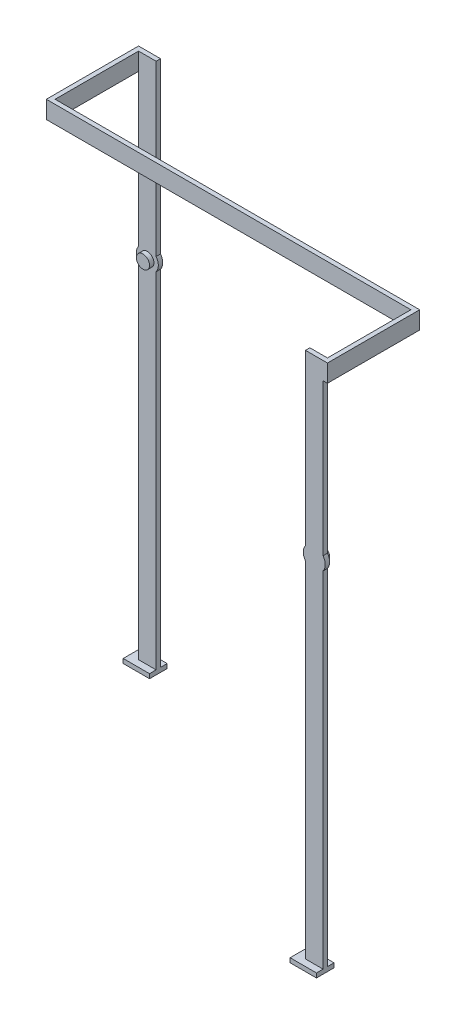
ISO-10303-21;
HEADER;
FILE_DESCRIPTION(('STEP AP214'),'2;1');
FILE_NAME('part.step','',(''),(''),'','','');
FILE_SCHEMA(('AUTOMOTIVE_DESIGN { 1 0 10303 214 1 1 1 1 }'));
ENDSEC;
DATA;
#1=APPLICATION_CONTEXT('core data for automotive mechanical design processes');
#2=APPLICATION_PROTOCOL_DEFINITION('international standard','automotive_design',2000,#1);
#3=PRODUCT_CONTEXT('',#1,'mechanical');
#4=PRODUCT('Part','Part','',(#3));
#5=PRODUCT_RELATED_PRODUCT_CATEGORY('part','',(#4));
#6=PRODUCT_DEFINITION_FORMATION('','',#4);
#7=PRODUCT_DEFINITION_CONTEXT('part definition',#1,'design');
#8=PRODUCT_DEFINITION('design','',#6,#7);
#9=PRODUCT_DEFINITION_SHAPE('','',#8);
#10=(LENGTH_UNIT() NAMED_UNIT(*) SI_UNIT(.MILLI.,.METRE.));
#11=(NAMED_UNIT(*) PLANE_ANGLE_UNIT() SI_UNIT($,.RADIAN.));
#12=(NAMED_UNIT(*) SI_UNIT($,.STERADIAN.) SOLID_ANGLE_UNIT());
#13=UNCERTAINTY_MEASURE_WITH_UNIT(LENGTH_MEASURE(1.E-05),#10,'distance_accuracy_value','');
#14=(GEOMETRIC_REPRESENTATION_CONTEXT(3) GLOBAL_UNCERTAINTY_ASSIGNED_CONTEXT((#13)) GLOBAL_UNIT_ASSIGNED_CONTEXT((#10,
#11,#12)) REPRESENTATION_CONTEXT('',''));
#15=CARTESIAN_POINT('',(0.,0.,0.));
#16=DIRECTION('',(0.,0.,1.));
#17=DIRECTION('',(1.,0.,0.));
#18=AXIS2_PLACEMENT_3D('',#15,#16,#17);
#19=CARTESIAN_POINT('',(-21.3512251283049,81.1533572870647,-20.5));
#20=DIRECTION('',(-1.,0.,0.));
#21=DIRECTION('',(0.,0.,1.));
#22=AXIS2_PLACEMENT_3D('',#19,#20,#21);
#23=PLANE('',#22);
#24=DIRECTION('',(0.,-1.,0.));
#25=VECTOR('',#24,1.);
#26=CARTESIAN_POINT('',(-21.3512251283049,85.1533572870647,-0.5));
#27=LINE('',#26,#25);
#28=CARTESIAN_POINT('',(-21.3512251283049,85.1533572870647,-0.5));
#29=VERTEX_POINT('',#28);
#30=CARTESIAN_POINT('',(-21.3512251283049,81.1533572870647,-0.5));
#31=VERTEX_POINT('',#30);
#32=EDGE_CURVE('E590',#29,#31,#27,.T.);
#33=ORIENTED_EDGE('',*,*,#32,.T.);
#34=DIRECTION('',(0.,0.,1.));
#35=VECTOR('',#34,1.);
#36=CARTESIAN_POINT('',(-21.3512251283049,81.1533572870647,-20.5));
#37=LINE('',#36,#35);
#38=CARTESIAN_POINT('',(-21.3512251283049,81.1533572870647,-19.5));
#39=VERTEX_POINT('',#38);
#40=EDGE_CURVE('E239',#39,#31,#37,.T.);
#41=ORIENTED_EDGE('',*,*,#40,.F.);
#42=DIRECTION('',(0.,1.,0.));
#43=VECTOR('',#42,1.);
#44=CARTESIAN_POINT('',(-21.3512251283049,45.15335728706,-19.5));
#45=LINE('',#44,#43);
#46=CARTESIAN_POINT('',(-21.3512251283049,85.1533572870647,-19.5));
#47=VERTEX_POINT('',#46);
#48=EDGE_CURVE('E267',#39,#47,#45,.T.);
#49=ORIENTED_EDGE('',*,*,#48,.T.);
#50=DIRECTION('',(0.,0.,-1.));
#51=VECTOR('',#50,1.);
#52=CARTESIAN_POINT('',(-21.3512251283049,85.1533572870647,-20.5));
#53=LINE('',#52,#51);
#54=EDGE_CURVE('E244',#29,#47,#53,.T.);
#55=ORIENTED_EDGE('',*,*,#54,.F.);
#56=EDGE_LOOP('',(#33,#41,#49,#55));
#57=FACE_BOUND('',#56,.T.);
#58=ADVANCED_FACE('F31',(#57),#23,.F.);
#59=CARTESIAN_POINT('',(-21.3512251283049,85.1533572870647,-20.5));
#60=DIRECTION('',(1.,0.,0.));
#61=DIRECTION('',(0.,1.,0.));
#62=AXIS2_PLACEMENT_3D('',#59,#60,#61);
#63=PLANE('',#62);
#64=CARTESIAN_POINT('',(-21.3512251283049,81.1533572870647,-20.5));
#65=VERTEX_POINT('',#64);
#66=EDGE_CURVE('E254',#65,#39,#37,.T.);
#67=ORIENTED_EDGE('',*,*,#66,.F.);
#68=DIRECTION('',(0.,1.,0.));
#69=VECTOR('',#68,1.);
#70=CARTESIAN_POINT('',(-21.3512251283049,85.1533572870647,-20.5));
#71=LINE('',#70,#69);
#72=CARTESIAN_POINT('',(-21.3512251283049,46.65335728706,-20.5));
#73=VERTEX_POINT('',#72);
#74=EDGE_CURVE('E274',#73,#65,#71,.T.);
#75=ORIENTED_EDGE('',*,*,#74,.F.);
#76=DIRECTION('',(0.,0.,1.));
#77=VECTOR('',#76,1.);
#78=CARTESIAN_POINT('',(-21.3512251283049,46.65335728706,-20.5));
#79=LINE('',#78,#77);
#80=CARTESIAN_POINT('',(-21.3512251283049,46.65335728706,-19.5));
#81=VERTEX_POINT('',#80);
#82=EDGE_CURVE('E286',#73,#81,#79,.T.);
#83=ORIENTED_EDGE('',*,*,#82,.T.);
#84=DIRECTION('',(0.,1.,0.));
#85=VECTOR('',#84,1.);
#86=CARTESIAN_POINT('',(-21.3512251283049,85.1533572870647,-19.5));
#87=LINE('',#86,#85);
#88=EDGE_CURVE('E129',#81,#39,#87,.T.);
#89=ORIENTED_EDGE('',*,*,#88,.T.);
#90=EDGE_LOOP('',(#67,#75,#83,#89));
#91=FACE_BOUND('',#90,.T.);
#92=ADVANCED_FACE('F285',(#91),#63,.F.);
#93=CARTESIAN_POINT('',(-19.3512251283049,45.15335728706,-19.5));
#94=DIRECTION('',(0.,0.,-1.));
#95=DIRECTION('',(0.,1.,0.));
#96=AXIS2_PLACEMENT_3D('',#93,#94,#95);
#97=PLANE('',#96);
#98=DIRECTION('',(0.,1.,0.));
#99=VECTOR('',#98,1.);
#100=CARTESIAN_POINT('',(-21.3512251283049,43.6533572870599,-19.5));
#101=LINE('',#100,#99);
#102=CARTESIAN_POINT('',(-21.3512251283049,-34.8466427129353,-19.5));
#103=VERTEX_POINT('',#102);
#104=CARTESIAN_POINT('',(-21.3512251283049,43.6533572870599,-19.5));
#105=VERTEX_POINT('',#104);
#106=EDGE_CURVE('E123',#103,#105,#101,.T.);
#107=ORIENTED_EDGE('',*,*,#106,.F.);
#108=DIRECTION('',(-1.,0.,0.));
#109=VECTOR('',#108,1.);
#110=CARTESIAN_POINT('',(-17.3512251283049,-34.8466427129353,-19.5));
#111=LINE('',#110,#109);
#112=CARTESIAN_POINT('',(-17.3512251283049,-34.8466427129353,-19.5));
#113=VERTEX_POINT('',#112);
#114=EDGE_CURVE('E141',#113,#103,#111,.T.);
#115=ORIENTED_EDGE('',*,*,#114,.F.);
#116=DIRECTION('',(0.,-1.,0.));
#117=VECTOR('',#116,1.);
#118=CARTESIAN_POINT('',(-17.3512251283049,43.65335728706,-19.5));
#119=LINE('',#118,#117);
#120=CARTESIAN_POINT('',(-17.3512251283049,43.65335728706,-19.5));
#121=VERTEX_POINT('',#120);
#122=EDGE_CURVE('E136',#121,#113,#119,.T.);
#123=ORIENTED_EDGE('',*,*,#122,.F.);
#124=CARTESIAN_POINT('',(-19.3512251283049,45.15335728706,-19.5));
#125=DIRECTION('',(0.,0.,-1.));
#126=DIRECTION('',(0.,1.,0.));
#127=AXIS2_PLACEMENT_3D('',#124,#125,#126);
#128=CIRCLE('',#127,2.5);
#129=CARTESIAN_POINT('',(-17.3512251283049,46.6533572870599,-19.5));
#130=VERTEX_POINT('',#129);
#131=EDGE_CURVE('E80',#130,#121,#128,.T.);
#132=ORIENTED_EDGE('',*,*,#131,.F.);
#133=DIRECTION('',(0.,-1.,0.));
#134=VECTOR('',#133,1.);
#135=CARTESIAN_POINT('',(-17.3512251283049,85.1533572870647,-19.5));
#136=LINE('',#135,#134);
#137=CARTESIAN_POINT('',(-17.3512251283049,85.1533572870647,-19.5));
#138=VERTEX_POINT('',#137);
#139=EDGE_CURVE('E73',#138,#130,#136,.T.);
#140=ORIENTED_EDGE('',*,*,#139,.F.);
#141=DIRECTION('',(1.,0.,0.));
#142=VECTOR('',#141,1.);
#143=CARTESIAN_POINT('',(-17.3512251283049,85.1533572870647,-19.5));
#144=LINE('',#143,#142);
#145=EDGE_CURVE('E132',#47,#138,#144,.T.);
#146=ORIENTED_EDGE('',*,*,#145,.F.);
#147=ORIENTED_EDGE('',*,*,#48,.F.);
#148=ORIENTED_EDGE('',*,*,#88,.F.);
#149=CARTESIAN_POINT('',(-19.3512251283049,45.15335728706,-19.5));
#150=DIRECTION('',(0.,0.,-1.));
#151=DIRECTION('',(0.,1.,0.));
#152=AXIS2_PLACEMENT_3D('',#149,#150,#151);
#153=CIRCLE('',#152,2.5);
#154=EDGE_CURVE('E126',#105,#81,#153,.T.);
#155=ORIENTED_EDGE('',*,*,#154,.F.);
#156=EDGE_LOOP('',(#107,#115,#123,#132,#140,#146,#147,#148,#155));
#157=FACE_BOUND('',#156,.T.);
#158=CARTESIAN_POINT('',(-19.351225128309,45.1533572870647,-19.5));
#159=DIRECTION('',(0.,0.,-1.));
#160=DIRECTION('',(0.,1.,0.));
#161=AXIS2_PLACEMENT_3D('',#158,#159,#160);
#162=CIRCLE('',#161,1.50000000000253);
#163=CARTESIAN_POINT('',(-19.351225128309,46.6533572870672,-19.5));
#164=VERTEX_POINT('',#163);
#165=EDGE_CURVE('E11',#164,#164,#162,.F.);
#166=ORIENTED_EDGE('',*,*,#165,.F.);
#167=EDGE_LOOP('',(#166));
#168=FACE_BOUND('',#167,.T.);
#169=ADVANCED_FACE('F300',(#157,#168),#97,.F.);
#170=CARTESIAN_POINT('',(-21.3512251283049,43.6533572870599,-20.5));
#171=DIRECTION('',(1.,0.,0.));
#172=DIRECTION('',(0.,1.,0.));
#173=AXIS2_PLACEMENT_3D('',#170,#171,#172);
#174=PLANE('',#173);
#175=ORIENTED_EDGE('',*,*,#106,.T.);
#176=DIRECTION('',(0.,0.,1.));
#177=VECTOR('',#176,1.);
#178=CARTESIAN_POINT('',(-21.3512251283049,43.6533572870599,-20.5));
#179=LINE('',#178,#177);
#180=CARTESIAN_POINT('',(-21.3512251283049,43.6533572870599,-20.5));
#181=VERTEX_POINT('',#180);
#182=EDGE_CURVE('E42',#181,#105,#179,.T.);
#183=ORIENTED_EDGE('',*,*,#182,.F.);
#184=DIRECTION('',(0.,1.,0.));
#185=VECTOR('',#184,1.);
#186=CARTESIAN_POINT('',(-21.3512251283049,43.6533572870599,-20.5));
#187=LINE('',#186,#185);
#188=CARTESIAN_POINT('',(-21.3512251283049,-34.8466427129353,-20.5));
#189=VERTEX_POINT('',#188);
#190=EDGE_CURVE('E144',#189,#181,#187,.T.);
#191=ORIENTED_EDGE('',*,*,#190,.F.);
#192=DIRECTION('',(0.,0.,1.));
#193=VECTOR('',#192,1.);
#194=CARTESIAN_POINT('',(-21.3512251283049,-34.8466427129353,-20.5));
#195=LINE('',#194,#193);
#196=EDGE_CURVE('E51',#189,#103,#195,.T.);
#197=ORIENTED_EDGE('',*,*,#196,.T.);
#198=EDGE_LOOP('',(#175,#183,#191,#197));
#199=FACE_BOUND('',#198,.T.);
#200=ADVANCED_FACE('F33',(#199),#174,.F.);
#201=CARTESIAN_POINT('',(-19.3512251283049,45.15335728706,-20.5));
#202=DIRECTION('',(0.,0.,1.));
#203=DIRECTION('',(0.,-1.,0.));
#204=AXIS2_PLACEMENT_3D('',#201,#202,#203);
#205=CYLINDRICAL_SURFACE('',#204,2.5);
#206=ORIENTED_EDGE('',*,*,#154,.T.);
#207=ORIENTED_EDGE('',*,*,#82,.F.);
#208=CARTESIAN_POINT('',(-19.3512251283049,45.15335728706,-20.5));
#209=DIRECTION('',(0.,0.,-1.));
#210=DIRECTION('',(0.,1.,0.));
#211=AXIS2_PLACEMENT_3D('',#208,#209,#210);
#212=CIRCLE('',#211,2.5);
#213=EDGE_CURVE('E89',#181,#73,#212,.T.);
#214=ORIENTED_EDGE('',*,*,#213,.F.);
#215=ORIENTED_EDGE('',*,*,#182,.T.);
#216=EDGE_LOOP('',(#206,#207,#214,#215));
#217=FACE_BOUND('',#216,.T.);
#218=ADVANCED_FACE('F535',(#217),#205,.T.);
#219=CARTESIAN_POINT('',(-17.3512251283049,85.1533572870647,-20.5));
#220=DIRECTION('',(0.,-1.,0.));
#221=DIRECTION('',(0.,0.,-1.));
#222=AXIS2_PLACEMENT_3D('',#219,#220,#221);
#223=PLANE('',#222);
#224=ORIENTED_EDGE('',*,*,#145,.T.);
#225=DIRECTION('',(0.,0.,1.));
#226=VECTOR('',#225,1.);
#227=CARTESIAN_POINT('',(-17.3512251283049,85.1533572870647,-20.5));
#228=LINE('',#227,#226);
#229=CARTESIAN_POINT('',(-17.3512251283049,85.1533572870647,-20.5));
#230=VERTEX_POINT('',#229);
#231=EDGE_CURVE('E112',#230,#138,#228,.T.);
#232=ORIENTED_EDGE('',*,*,#231,.F.);
#233=DIRECTION('',(1.,0.,0.));
#234=VECTOR('',#233,1.);
#235=CARTESIAN_POINT('',(-17.3512251283049,85.1533572870647,-20.5));
#236=LINE('',#235,#234);
#237=CARTESIAN_POINT('',(-22.3512251283049,85.1533572870647,-20.5));
#238=VERTEX_POINT('',#237);
#239=EDGE_CURVE('E107',#238,#230,#236,.T.);
#240=ORIENTED_EDGE('',*,*,#239,.F.);
#241=DIRECTION('',(0.,0.,-1.));
#242=VECTOR('',#241,1.);
#243=CARTESIAN_POINT('',(-22.3512251283049,85.1533572870647,-20.5));
#244=LINE('',#243,#242);
#245=CARTESIAN_POINT('',(-22.3512251283049,85.1533572870647,0.5));
#246=VERTEX_POINT('',#245);
#247=EDGE_CURVE('E250',#246,#238,#244,.T.);
#248=ORIENTED_EDGE('',*,*,#247,.F.);
#249=DIRECTION('',(1.,0.,0.));
#250=VECTOR('',#249,1.);
#251=CARTESIAN_POINT('',(-22.3512251283049,85.1533572870647,0.5));
#252=LINE('',#251,#250);
#253=CARTESIAN_POINT('',(60.6487748716867,85.1533572870647,0.5));
#254=VERTEX_POINT('',#253);
#255=EDGE_CURVE('E253',#246,#254,#252,.T.);
#256=ORIENTED_EDGE('',*,*,#255,.T.);
#257=DIRECTION('',(0.,0.,1.));
#258=VECTOR('',#257,1.);
#259=CARTESIAN_POINT('',(60.6487748716867,85.1533572870631,20.5));
#260=LINE('',#259,#258);
#261=CARTESIAN_POINT('',(60.6487748716867,85.1533572870631,19.5));
#262=VERTEX_POINT('',#261);
#263=EDGE_CURVE('E602',#254,#262,#260,.T.);
#264=ORIENTED_EDGE('',*,*,#263,.T.);
#265=DIRECTION('',(-1.,0.,0.));
#266=VECTOR('',#265,1.);
#267=CARTESIAN_POINT('',(56.6487748716867,85.1533572870631,19.5));
#268=LINE('',#267,#266);
#269=CARTESIAN_POINT('',(56.6487748716867,85.1533572870631,19.5));
#270=VERTEX_POINT('',#269);
#271=EDGE_CURVE('E210',#262,#270,#268,.T.);
#272=ORIENTED_EDGE('',*,*,#271,.T.);
#273=DIRECTION('',(0.,0.,-1.));
#274=VECTOR('',#273,1.);
#275=CARTESIAN_POINT('',(56.6487748716867,85.1533572870631,20.5));
#276=LINE('',#275,#274);
#277=CARTESIAN_POINT('',(56.6487748716867,85.1533572870631,20.5));
#278=VERTEX_POINT('',#277);
#279=EDGE_CURVE('E228',#278,#270,#276,.T.);
#280=ORIENTED_EDGE('',*,*,#279,.F.);
#281=DIRECTION('',(-1.,0.,0.));
#282=VECTOR('',#281,1.);
#283=CARTESIAN_POINT('',(56.6487748716867,85.1533572870631,20.5));
#284=LINE('',#283,#282);
#285=CARTESIAN_POINT('',(61.6487748716867,85.1533572870631,20.5));
#286=VERTEX_POINT('',#285);
#287=EDGE_CURVE('E194',#286,#278,#284,.T.);
#288=ORIENTED_EDGE('',*,*,#287,.F.);
#289=DIRECTION('',(0.,0.,1.));
#290=VECTOR('',#289,1.);
#291=CARTESIAN_POINT('',(61.6487748716867,85.1533572870631,20.5));
#292=LINE('',#291,#290);
#293=CARTESIAN_POINT('',(61.6487748716867,85.1533572870625,-0.5));
#294=VERTEX_POINT('',#293);
#295=EDGE_CURVE('E606',#294,#286,#292,.T.);
#296=ORIENTED_EDGE('',*,*,#295,.F.);
#297=DIRECTION('',(-1.,0.,0.));
#298=VECTOR('',#297,1.);
#299=CARTESIAN_POINT('',(61.6487748716867,85.1533572870625,-0.5));
#300=LINE('',#299,#298);
#301=EDGE_CURVE('E609',#294,#29,#300,.T.);
#302=ORIENTED_EDGE('',*,*,#301,.T.);
#303=ORIENTED_EDGE('',*,*,#54,.T.);
#304=EDGE_LOOP('',(#224,#232,#240,#248,#256,#264,#272,#280,#288,#296,#302,#303));
#305=FACE_BOUND('',#304,.T.);
#306=ADVANCED_FACE('F533',(#305),#223,.F.);
#307=CARTESIAN_POINT('',(-17.3512251283049,85.1533572870647,-20.5));
#308=DIRECTION('',(-1.,0.,0.));
#309=DIRECTION('',(0.,-1.,0.));
#310=AXIS2_PLACEMENT_3D('',#307,#308,#309);
#311=PLANE('',#310);
#312=ORIENTED_EDGE('',*,*,#139,.T.);
#313=DIRECTION('',(0.,0.,1.));
#314=VECTOR('',#313,1.);
#315=CARTESIAN_POINT('',(-17.3512251283049,46.6533572870599,-20.5));
#316=LINE('',#315,#314);
#317=CARTESIAN_POINT('',(-17.3512251283049,46.6533572870599,-20.5));
#318=VERTEX_POINT('',#317);
#319=EDGE_CURVE('E110',#318,#130,#316,.T.);
#320=ORIENTED_EDGE('',*,*,#319,.F.);
#321=DIRECTION('',(0.,-1.,0.));
#322=VECTOR('',#321,1.);
#323=CARTESIAN_POINT('',(-17.3512251283049,85.1533572870647,-20.5));
#324=LINE('',#323,#322);
#325=EDGE_CURVE('E100',#230,#318,#324,.T.);
#326=ORIENTED_EDGE('',*,*,#325,.F.);
#327=ORIENTED_EDGE('',*,*,#231,.T.);
#328=EDGE_LOOP('',(#312,#320,#326,#327));
#329=FACE_BOUND('',#328,.T.);
#330=ADVANCED_FACE('F111',(#329),#311,.F.);
#331=CARTESIAN_POINT('',(-19.3512251283049,45.15335728706,-20.5));
#332=DIRECTION('',(0.,0.,1.));
#333=DIRECTION('',(0.,-1.,0.));
#334=AXIS2_PLACEMENT_3D('',#331,#332,#333);
#335=CYLINDRICAL_SURFACE('',#334,2.5);
#336=ORIENTED_EDGE('',*,*,#131,.T.);
#337=DIRECTION('',(0.,0.,1.));
#338=VECTOR('',#337,1.);
#339=CARTESIAN_POINT('',(-17.3512251283049,43.65335728706,-20.5));
#340=LINE('',#339,#338);
#341=CARTESIAN_POINT('',(-17.3512251283049,43.65335728706,-20.5));
#342=VERTEX_POINT('',#341);
#343=EDGE_CURVE('E113',#342,#121,#340,.T.);
#344=ORIENTED_EDGE('',*,*,#343,.F.);
#345=CARTESIAN_POINT('',(-19.3512251283049,45.15335728706,-20.5));
#346=DIRECTION('',(0.,0.,-1.));
#347=DIRECTION('',(0.,1.,0.));
#348=AXIS2_PLACEMENT_3D('',#345,#346,#347);
#349=CIRCLE('',#348,2.5);
#350=EDGE_CURVE('E104',#318,#342,#349,.T.);
#351=ORIENTED_EDGE('',*,*,#350,.F.);
#352=ORIENTED_EDGE('',*,*,#319,.T.);
#353=EDGE_LOOP('',(#336,#344,#351,#352));
#354=FACE_BOUND('',#353,.T.);
#355=ADVANCED_FACE('F115',(#354),#335,.T.);
#356=CARTESIAN_POINT('',(-17.3512251283049,43.65335728706,-20.5));
#357=DIRECTION('',(-1.,0.,0.));
#358=DIRECTION('',(0.,-1.,0.));
#359=AXIS2_PLACEMENT_3D('',#356,#357,#358);
#360=PLANE('',#359);
#361=ORIENTED_EDGE('',*,*,#122,.T.);
#362=DIRECTION('',(0.,0.,1.));
#363=VECTOR('',#362,1.);
#364=CARTESIAN_POINT('',(-17.3512251283049,-34.8466427129353,-22.));
#365=LINE('',#364,#363);
#366=CARTESIAN_POINT('',(-17.3512251283049,-34.8466427129353,-18.));
#367=VERTEX_POINT('',#366);
#368=EDGE_CURVE('E452',#113,#367,#365,.T.);
#369=ORIENTED_EDGE('',*,*,#368,.T.);
#370=DIRECTION('',(0.,1.,0.));
#371=VECTOR('',#370,1.);
#372=CARTESIAN_POINT('',(-17.3512251283049,-35.8466427129353,-18.));
#373=LINE('',#372,#371);
#374=CARTESIAN_POINT('',(-17.3512251283049,-35.8466427129353,-18.));
#375=VERTEX_POINT('',#374);
#376=EDGE_CURVE('E567',#375,#367,#373,.T.);
#377=ORIENTED_EDGE('',*,*,#376,.F.);
#378=DIRECTION('',(0.,0.,1.));
#379=VECTOR('',#378,1.);
#380=CARTESIAN_POINT('',(-17.3512251283049,-35.8466427129353,-22.));
#381=LINE('',#380,#379);
#382=CARTESIAN_POINT('',(-17.3512251283049,-35.8466427129353,-22.));
#383=VERTEX_POINT('',#382);
#384=EDGE_CURVE('E579',#383,#375,#381,.T.);
#385=ORIENTED_EDGE('',*,*,#384,.F.);
#386=DIRECTION('',(0.,1.,0.));
#387=VECTOR('',#386,1.);
#388=CARTESIAN_POINT('',(-17.3512251283049,-35.8466427129353,-22.));
#389=LINE('',#388,#387);
#390=CARTESIAN_POINT('',(-17.3512251283049,-34.8466427129353,-22.));
#391=VERTEX_POINT('',#390);
#392=EDGE_CURVE('E559',#383,#391,#389,.T.);
#393=ORIENTED_EDGE('',*,*,#392,.T.);
#394=CARTESIAN_POINT('',(-17.3512251283049,-34.8466427129353,-20.5));
#395=VERTEX_POINT('',#394);
#396=EDGE_CURVE('E454',#391,#395,#365,.T.);
#397=ORIENTED_EDGE('',*,*,#396,.T.);
#398=DIRECTION('',(0.,-1.,0.));
#399=VECTOR('',#398,1.);
#400=CARTESIAN_POINT('',(-17.3512251283049,43.65335728706,-20.5));
#401=LINE('',#400,#399);
#402=EDGE_CURVE('E117',#342,#395,#401,.T.);
#403=ORIENTED_EDGE('',*,*,#402,.F.);
#404=ORIENTED_EDGE('',*,*,#343,.T.);
#405=EDGE_LOOP('',(#361,#369,#377,#385,#393,#397,#403,#404));
#406=FACE_BOUND('',#405,.T.);
#407=ADVANCED_FACE('F523',(#406),#360,.F.);
#408=CARTESIAN_POINT('',(-19.3512251283049,45.15335728706,-20.5));
#409=DIRECTION('',(0.,0.,-1.));
#410=DIRECTION('',(0.,1.,0.));
#411=AXIS2_PLACEMENT_3D('',#408,#409,#410);
#412=PLANE('',#411);
#413=ORIENTED_EDGE('',*,*,#190,.T.);
#414=ORIENTED_EDGE('',*,*,#213,.T.);
#415=ORIENTED_EDGE('',*,*,#74,.T.);
#416=DIRECTION('',(1.,0.,0.));
#417=VECTOR('',#416,1.);
#418=CARTESIAN_POINT('',(-22.3512251283049,81.1533572870647,-20.5));
#419=LINE('',#418,#417);
#420=CARTESIAN_POINT('',(-22.3512251283049,81.1533572870647,-20.5));
#421=VERTEX_POINT('',#420);
#422=EDGE_CURVE('E264',#421,#65,#419,.T.);
#423=ORIENTED_EDGE('',*,*,#422,.F.);
#424=DIRECTION('',(0.,-1.,0.));
#425=VECTOR('',#424,1.);
#426=CARTESIAN_POINT('',(-22.3512251283049,85.1533572870647,-20.5));
#427=LINE('',#426,#425);
#428=EDGE_CURVE('E240',#238,#421,#427,.T.);
#429=ORIENTED_EDGE('',*,*,#428,.F.);
#430=ORIENTED_EDGE('',*,*,#239,.T.);
#431=ORIENTED_EDGE('',*,*,#325,.T.);
#432=ORIENTED_EDGE('',*,*,#350,.T.);
#433=ORIENTED_EDGE('',*,*,#402,.T.);
#434=DIRECTION('',(-1.,0.,0.));
#435=VECTOR('',#434,1.);
#436=CARTESIAN_POINT('',(-17.3512251283049,-34.8466427129353,-20.5));
#437=LINE('',#436,#435);
#438=EDGE_CURVE('E119',#395,#189,#437,.T.);
#439=ORIENTED_EDGE('',*,*,#438,.T.);
#440=EDGE_LOOP('',(#413,#414,#415,#423,#429,#430,#431,#432,#433,#439));
#441=FACE_BOUND('',#440,.T.);
#442=ADVANCED_FACE('F101',(#441),#412,.T.);
#443=CARTESIAN_POINT('',(-19.351225128309,45.1533572870647,-18.5));
#444=DIRECTION('',(0.,0.,-1.));
#445=DIRECTION('',(-1.,0.,0.));
#446=AXIS2_PLACEMENT_3D('',#443,#444,#445);
#447=CYLINDRICAL_SURFACE('',#446,1.50000000000253);
#448=CARTESIAN_POINT('',(-19.351225128309,45.1533572870647,-18.5));
#449=DIRECTION('',(0.,0.,1.));
#450=DIRECTION('',(1.,0.,0.));
#451=AXIS2_PLACEMENT_3D('',#448,#449,#450);
#452=CIRCLE('',#451,1.50000000000253);
#453=CARTESIAN_POINT('',(-17.8512251283064,45.1533572870647,-18.5));
#454=VERTEX_POINT('',#453);
#455=EDGE_CURVE('E127',#454,#454,#452,.T.);
#456=ORIENTED_EDGE('',*,*,#455,.F.);
#457=EDGE_LOOP('',(#456));
#458=FACE_BOUND('',#457,.T.);
#459=ORIENTED_EDGE('',*,*,#165,.T.);
#460=EDGE_LOOP('',(#459));
#461=FACE_BOUND('',#460,.T.);
#462=ADVANCED_FACE('F516',(#458,#461),#447,.T.);
#463=CARTESIAN_POINT('',(-19.351225128309,45.1533572870647,-18.5));
#464=DIRECTION('',(0.,0.,1.));
#465=DIRECTION('',(1.,0.,0.));
#466=AXIS2_PLACEMENT_3D('',#463,#464,#465);
#467=PLANE('',#466);
#468=ORIENTED_EDGE('',*,*,#455,.T.);
#469=EDGE_LOOP('',(#468));
#470=FACE_BOUND('',#469,.T.);
#471=ADVANCED_FACE('F513',(#470),#467,.T.);
#472=CARTESIAN_POINT('',(-22.3512251283049,81.1533572870647,-20.5));
#473=DIRECTION('',(0.,1.,0.));
#474=DIRECTION('',(0.,0.,1.));
#475=AXIS2_PLACEMENT_3D('',#472,#473,#474);
#476=PLANE('',#475);
#477=ORIENTED_EDGE('',*,*,#66,.T.);
#478=ORIENTED_EDGE('',*,*,#40,.T.);
#479=DIRECTION('',(-1.,0.,0.));
#480=VECTOR('',#479,1.);
#481=CARTESIAN_POINT('',(61.6487748716867,81.1533572870647,-0.5));
#482=LINE('',#481,#480);
#483=CARTESIAN_POINT('',(61.6487748716867,81.1533572870647,-0.5));
#484=VERTEX_POINT('',#483);
#485=EDGE_CURVE('E615',#484,#31,#482,.T.);
#486=ORIENTED_EDGE('',*,*,#485,.F.);
#487=DIRECTION('',(0.,0.,-1.));
#488=VECTOR('',#487,1.);
#489=CARTESIAN_POINT('',(61.6487748716867,81.1533572870647,20.5));
#490=LINE('',#489,#488);
#491=CARTESIAN_POINT('',(61.6487748716867,81.1533572870647,20.5));
#492=VERTEX_POINT('',#491);
#493=EDGE_CURVE('E601',#492,#484,#490,.T.);
#494=ORIENTED_EDGE('',*,*,#493,.F.);
#495=DIRECTION('',(-1.,0.,0.));
#496=VECTOR('',#495,1.);
#497=CARTESIAN_POINT('',(61.6487748716867,81.1533572870647,20.5));
#498=LINE('',#497,#496);
#499=CARTESIAN_POINT('',(60.6487748716867,81.1533572870647,20.5));
#500=VERTEX_POINT('',#499);
#501=EDGE_CURVE('E185',#492,#500,#498,.T.);
#502=ORIENTED_EDGE('',*,*,#501,.T.);
#503=DIRECTION('',(0.,0.,-1.));
#504=VECTOR('',#503,1.);
#505=CARTESIAN_POINT('',(60.6487748716867,81.1533572870647,20.5));
#506=LINE('',#505,#504);
#507=CARTESIAN_POINT('',(60.6487748716867,81.1533572870647,19.5));
#508=VERTEX_POINT('',#507);
#509=EDGE_CURVE('E610',#500,#508,#506,.T.);
#510=ORIENTED_EDGE('',*,*,#509,.T.);
#511=CARTESIAN_POINT('',(60.6487748716867,81.1533572870647,0.5));
#512=VERTEX_POINT('',#511);
#513=EDGE_CURVE('E596',#508,#512,#506,.T.);
#514=ORIENTED_EDGE('',*,*,#513,.T.);
#515=DIRECTION('',(1.,0.,0.));
#516=VECTOR('',#515,1.);
#517=CARTESIAN_POINT('',(-22.3512251283049,81.1533572870647,0.5));
#518=LINE('',#517,#516);
#519=CARTESIAN_POINT('',(-22.3512251283049,81.1533572870647,0.5));
#520=VERTEX_POINT('',#519);
#521=EDGE_CURVE('E261',#520,#512,#518,.T.);
#522=ORIENTED_EDGE('',*,*,#521,.F.);
#523=DIRECTION('',(0.,0.,1.));
#524=VECTOR('',#523,1.);
#525=CARTESIAN_POINT('',(-22.3512251283049,81.1533572870647,-20.5));
#526=LINE('',#525,#524);
#527=EDGE_CURVE('E243',#421,#520,#526,.T.);
#528=ORIENTED_EDGE('',*,*,#527,.F.);
#529=ORIENTED_EDGE('',*,*,#422,.T.);
#530=EDGE_LOOP('',(#477,#478,#486,#494,#502,#510,#514,#522,#528,#529));
#531=FACE_BOUND('',#530,.T.);
#532=ADVANCED_FACE('F291',(#531),#476,.F.);
#533=CARTESIAN_POINT('',(-22.3512251283049,85.1533572870647,0.5));
#534=DIRECTION('',(0.,0.,-1.));
#535=DIRECTION('',(0.,1.,0.));
#536=AXIS2_PLACEMENT_3D('',#533,#534,#535);
#537=PLANE('',#536);
#538=ORIENTED_EDGE('',*,*,#521,.T.);
#539=DIRECTION('',(0.,1.,0.));
#540=VECTOR('',#539,1.);
#541=CARTESIAN_POINT('',(60.6487748716867,85.1533572870647,0.5));
#542=LINE('',#541,#540);
#543=EDGE_CURVE('E592',#512,#254,#542,.T.);
#544=ORIENTED_EDGE('',*,*,#543,.T.);
#545=ORIENTED_EDGE('',*,*,#255,.F.);
#546=DIRECTION('',(0.,1.,0.));
#547=VECTOR('',#546,1.);
#548=CARTESIAN_POINT('',(-22.3512251283049,85.1533572870647,0.5));
#549=LINE('',#548,#547);
#550=EDGE_CURVE('E247',#520,#246,#549,.T.);
#551=ORIENTED_EDGE('',*,*,#550,.F.);
#552=EDGE_LOOP('',(#538,#544,#545,#551));
#553=FACE_BOUND('',#552,.T.);
#554=ADVANCED_FACE('F507',(#553),#537,.F.);
#555=CARTESIAN_POINT('',(-22.3512251283049,81.1533572870647,-20.5));
#556=DIRECTION('',(-1.,0.,0.));
#557=DIRECTION('',(0.,0.,1.));
#558=AXIS2_PLACEMENT_3D('',#555,#556,#557);
#559=PLANE('',#558);
#560=ORIENTED_EDGE('',*,*,#428,.T.);
#561=ORIENTED_EDGE('',*,*,#527,.T.);
#562=ORIENTED_EDGE('',*,*,#550,.T.);
#563=ORIENTED_EDGE('',*,*,#247,.T.);
#564=EDGE_LOOP('',(#560,#561,#562,#563));
#565=FACE_BOUND('',#564,.T.);
#566=ADVANCED_FACE('F506',(#565),#559,.T.);
#567=CARTESIAN_POINT('',(60.6487748716867,85.1533572870631,20.5));
#568=DIRECTION('',(-1.,0.,0.));
#569=DIRECTION('',(0.,-1.,0.));
#570=AXIS2_PLACEMENT_3D('',#567,#568,#569);
#571=PLANE('',#570);
#572=ORIENTED_EDGE('',*,*,#509,.F.);
#573=DIRECTION('',(0.,1.,0.));
#574=VECTOR('',#573,1.);
#575=CARTESIAN_POINT('',(60.6487748716867,85.1533572870631,20.5));
#576=LINE('',#575,#574);
#577=CARTESIAN_POINT('',(60.6487748716867,46.6533572870633,20.5));
#578=VERTEX_POINT('',#577);
#579=EDGE_CURVE('E191',#578,#500,#576,.T.);
#580=ORIENTED_EDGE('',*,*,#579,.F.);
#581=DIRECTION('',(0.,0.,-1.));
#582=VECTOR('',#581,1.);
#583=CARTESIAN_POINT('',(60.6487748716867,46.6533572870633,20.5));
#584=LINE('',#583,#582);
#585=CARTESIAN_POINT('',(60.6487748716867,46.6533572870633,19.5));
#586=VERTEX_POINT('',#585);
#587=EDGE_CURVE('E231',#578,#586,#584,.T.);
#588=ORIENTED_EDGE('',*,*,#587,.T.);
#589=DIRECTION('',(0.,1.,0.));
#590=VECTOR('',#589,1.);
#591=CARTESIAN_POINT('',(60.6487748716867,85.1533572870631,19.5));
#592=LINE('',#591,#590);
#593=EDGE_CURVE('E170',#586,#508,#592,.T.);
#594=ORIENTED_EDGE('',*,*,#593,.T.);
#595=EDGE_LOOP('',(#572,#580,#588,#594));
#596=FACE_BOUND('',#595,.T.);
#597=ADVANCED_FACE('F495',(#596),#571,.F.);
#598=CARTESIAN_POINT('',(58.6487748716868,45.1533572870631,19.5));
#599=DIRECTION('',(0.,0.,1.));
#600=DIRECTION('',(1.,0.,0.));
#601=AXIS2_PLACEMENT_3D('',#598,#599,#600);
#602=PLANE('',#601);
#603=DIRECTION('',(1.,0.,0.));
#604=VECTOR('',#603,1.);
#605=CARTESIAN_POINT('',(56.6487748716867,-34.8466427129369,19.5));
#606=LINE('',#605,#604);
#607=CARTESIAN_POINT('',(56.6487748716867,-34.8466427129369,19.5));
#608=VERTEX_POINT('',#607);
#609=CARTESIAN_POINT('',(60.6487748716867,-34.8466427129369,19.5));
#610=VERTEX_POINT('',#609);
#611=EDGE_CURVE('E35',#608,#610,#606,.T.);
#612=ORIENTED_EDGE('',*,*,#611,.F.);
#613=DIRECTION('',(0.,-1.,0.));
#614=VECTOR('',#613,1.);
#615=CARTESIAN_POINT('',(56.6487748716867,43.6533572870633,19.5));
#616=LINE('',#615,#614);
#617=CARTESIAN_POINT('',(56.6487748716867,43.6533572870633,19.5));
#618=VERTEX_POINT('',#617);
#619=EDGE_CURVE('E156',#618,#608,#616,.T.);
#620=ORIENTED_EDGE('',*,*,#619,.F.);
#621=CARTESIAN_POINT('',(58.6487748716868,45.1533572870631,19.5));
#622=DIRECTION('',(0.,0.,1.));
#623=DIRECTION('',(1.,0.,0.));
#624=AXIS2_PLACEMENT_3D('',#621,#622,#623);
#625=CIRCLE('',#624,2.5);
#626=CARTESIAN_POINT('',(56.6487748716867,46.653357287063,19.5));
#627=VERTEX_POINT('',#626);
#628=EDGE_CURVE('E216',#627,#618,#625,.T.);
#629=ORIENTED_EDGE('',*,*,#628,.F.);
#630=DIRECTION('',(0.,-1.,0.));
#631=VECTOR('',#630,1.);
#632=CARTESIAN_POINT('',(56.6487748716867,85.1533572870631,19.5));
#633=LINE('',#632,#631);
#634=EDGE_CURVE('E213',#270,#627,#633,.T.);
#635=ORIENTED_EDGE('',*,*,#634,.F.);
#636=ORIENTED_EDGE('',*,*,#271,.F.);
#637=DIRECTION('',(0.,1.,0.));
#638=VECTOR('',#637,1.);
#639=CARTESIAN_POINT('',(60.6487748716867,45.1533572870631,19.5));
#640=LINE('',#639,#638);
#641=EDGE_CURVE('E180',#508,#262,#640,.T.);
#642=ORIENTED_EDGE('',*,*,#641,.F.);
#643=ORIENTED_EDGE('',*,*,#593,.F.);
#644=CARTESIAN_POINT('',(58.6487748716868,45.1533572870631,19.5));
#645=DIRECTION('',(0.,0.,1.));
#646=DIRECTION('',(1.,0.,0.));
#647=AXIS2_PLACEMENT_3D('',#644,#645,#646);
#648=CIRCLE('',#647,2.5);
#649=CARTESIAN_POINT('',(60.6487748716867,43.653357287063,19.5));
#650=VERTEX_POINT('',#649);
#651=EDGE_CURVE('E161',#650,#586,#648,.T.);
#652=ORIENTED_EDGE('',*,*,#651,.F.);
#653=DIRECTION('',(0.,1.,0.));
#654=VECTOR('',#653,1.);
#655=CARTESIAN_POINT('',(60.6487748716867,43.653357287063,19.5));
#656=LINE('',#655,#654);
#657=EDGE_CURVE('E159',#610,#650,#656,.T.);
#658=ORIENTED_EDGE('',*,*,#657,.F.);
#659=EDGE_LOOP('',(#612,#620,#629,#635,#636,#642,#643,#652,#658));
#660=FACE_BOUND('',#659,.T.);
#661=CARTESIAN_POINT('',(58.6487748716876,45.1533572870629,19.5));
#662=DIRECTION('',(0.,0.,1.));
#663=DIRECTION('',(1.,0.,0.));
#664=AXIS2_PLACEMENT_3D('',#661,#662,#663);
#665=CIRCLE('',#664,1.49999999999558);
#666=CARTESIAN_POINT('',(60.1487748716832,45.1533572870629,19.5));
#667=VERTEX_POINT('',#666);
#668=EDGE_CURVE('E236',#667,#667,#665,.F.);
#669=ORIENTED_EDGE('',*,*,#668,.F.);
#670=EDGE_LOOP('',(#669));
#671=FACE_BOUND('',#670,.T.);
#672=ADVANCED_FACE('F486',(#660,#671),#602,.F.);
#673=CARTESIAN_POINT('',(60.6487748716867,43.653357287063,20.5));
#674=DIRECTION('',(-1.,0.,0.));
#675=DIRECTION('',(0.,-1.,0.));
#676=AXIS2_PLACEMENT_3D('',#673,#674,#675);
#677=PLANE('',#676);
#678=ORIENTED_EDGE('',*,*,#657,.T.);
#679=DIRECTION('',(0.,0.,-1.));
#680=VECTOR('',#679,1.);
#681=CARTESIAN_POINT('',(60.6487748716867,43.653357287063,20.5));
#682=LINE('',#681,#680);
#683=CARTESIAN_POINT('',(60.6487748716867,43.653357287063,20.5));
#684=VERTEX_POINT('',#683);
#685=EDGE_CURVE('E234',#684,#650,#682,.T.);
#686=ORIENTED_EDGE('',*,*,#685,.F.);
#687=DIRECTION('',(0.,1.,0.));
#688=VECTOR('',#687,1.);
#689=CARTESIAN_POINT('',(60.6487748716867,43.653357287063,20.5));
#690=LINE('',#689,#688);
#691=CARTESIAN_POINT('',(60.6487748716867,-34.8466427129369,20.5));
#692=VERTEX_POINT('',#691);
#693=EDGE_CURVE('E147',#692,#684,#690,.T.);
#694=ORIENTED_EDGE('',*,*,#693,.F.);
#695=DIRECTION('',(0.,0.,1.));
#696=VECTOR('',#695,1.);
#697=CARTESIAN_POINT('',(60.6487748716867,-34.846642712937,22.));
#698=LINE('',#697,#696);
#699=CARTESIAN_POINT('',(60.6487748716867,-34.846642712937,22.));
#700=VERTEX_POINT('',#699);
#701=EDGE_CURVE('E463',#692,#700,#698,.T.);
#702=ORIENTED_EDGE('',*,*,#701,.T.);
#703=DIRECTION('',(0.,1.,0.));
#704=VECTOR('',#703,1.);
#705=CARTESIAN_POINT('',(60.6487748716867,-35.846642712937,22.));
#706=LINE('',#705,#704);
#707=CARTESIAN_POINT('',(60.6487748716867,-35.846642712937,22.));
#708=VERTEX_POINT('',#707);
#709=EDGE_CURVE('E456',#708,#700,#706,.T.);
#710=ORIENTED_EDGE('',*,*,#709,.F.);
#711=DIRECTION('',(0.,0.,1.));
#712=VECTOR('',#711,1.);
#713=CARTESIAN_POINT('',(60.6487748716867,-35.846642712937,22.));
#714=LINE('',#713,#712);
#715=CARTESIAN_POINT('',(60.6487748716867,-35.846642712937,18.));
#716=VERTEX_POINT('',#715);
#717=EDGE_CURVE('E437',#716,#708,#714,.T.);
#718=ORIENTED_EDGE('',*,*,#717,.F.);
#719=DIRECTION('',(0.,1.,0.));
#720=VECTOR('',#719,1.);
#721=CARTESIAN_POINT('',(60.6487748716867,-35.846642712937,18.));
#722=LINE('',#721,#720);
#723=CARTESIAN_POINT('',(60.6487748716867,-34.846642712937,18.));
#724=VERTEX_POINT('',#723);
#725=EDGE_CURVE('E434',#716,#724,#722,.T.);
#726=ORIENTED_EDGE('',*,*,#725,.T.);
#727=EDGE_CURVE('E460',#724,#610,#698,.T.);
#728=ORIENTED_EDGE('',*,*,#727,.T.);
#729=EDGE_LOOP('',(#678,#686,#694,#702,#710,#718,#726,#728));
#730=FACE_BOUND('',#729,.T.);
#731=ADVANCED_FACE('F483',(#730),#677,.F.);
#732=CARTESIAN_POINT('',(58.6487748716868,45.1533572870631,20.5));
#733=DIRECTION('',(0.,0.,-1.));
#734=DIRECTION('',(-1.,0.,0.));
#735=AXIS2_PLACEMENT_3D('',#732,#733,#734);
#736=CYLINDRICAL_SURFACE('',#735,2.5);
#737=ORIENTED_EDGE('',*,*,#651,.T.);
#738=ORIENTED_EDGE('',*,*,#587,.F.);
#739=CARTESIAN_POINT('',(58.6487748716868,45.1533572870631,20.5));
#740=DIRECTION('',(0.,0.,1.));
#741=DIRECTION('',(1.,0.,0.));
#742=AXIS2_PLACEMENT_3D('',#739,#740,#741);
#743=CIRCLE('',#742,2.5);
#744=EDGE_CURVE('E150',#684,#578,#743,.T.);
#745=ORIENTED_EDGE('',*,*,#744,.F.);
#746=ORIENTED_EDGE('',*,*,#685,.T.);
#747=EDGE_LOOP('',(#737,#738,#745,#746));
#748=FACE_BOUND('',#747,.T.);
#749=ADVANCED_FACE('F485',(#748),#736,.T.);
#750=CARTESIAN_POINT('',(56.6487748716867,85.1533572870631,20.5));
#751=DIRECTION('',(1.,0.,0.));
#752=DIRECTION('',(0.,1.,0.));
#753=AXIS2_PLACEMENT_3D('',#750,#751,#752);
#754=PLANE('',#753);
#755=ORIENTED_EDGE('',*,*,#634,.T.);
#756=DIRECTION('',(0.,0.,-1.));
#757=VECTOR('',#756,1.);
#758=CARTESIAN_POINT('',(56.6487748716867,46.653357287063,20.5));
#759=LINE('',#758,#757);
#760=CARTESIAN_POINT('',(56.6487748716867,46.653357287063,20.5));
#761=VERTEX_POINT('',#760);
#762=EDGE_CURVE('E225',#761,#627,#759,.T.);
#763=ORIENTED_EDGE('',*,*,#762,.F.);
#764=DIRECTION('',(0.,-1.,0.));
#765=VECTOR('',#764,1.);
#766=CARTESIAN_POINT('',(56.6487748716867,85.1533572870631,20.5));
#767=LINE('',#766,#765);
#768=EDGE_CURVE('E197',#278,#761,#767,.T.);
#769=ORIENTED_EDGE('',*,*,#768,.F.);
#770=ORIENTED_EDGE('',*,*,#279,.T.);
#771=EDGE_LOOP('',(#755,#763,#769,#770));
#772=FACE_BOUND('',#771,.T.);
#773=ADVANCED_FACE('F492',(#772),#754,.F.);
#774=CARTESIAN_POINT('',(58.6487748716868,45.1533572870631,20.5));
#775=DIRECTION('',(0.,0.,-1.));
#776=DIRECTION('',(-1.,0.,0.));
#777=AXIS2_PLACEMENT_3D('',#774,#775,#776);
#778=CYLINDRICAL_SURFACE('',#777,2.5);
#779=ORIENTED_EDGE('',*,*,#628,.T.);
#780=DIRECTION('',(0.,0.,-1.));
#781=VECTOR('',#780,1.);
#782=CARTESIAN_POINT('',(56.6487748716867,43.6533572870633,20.5));
#783=LINE('',#782,#781);
#784=CARTESIAN_POINT('',(56.6487748716867,43.6533572870633,20.5));
#785=VERTEX_POINT('',#784);
#786=EDGE_CURVE('E222',#785,#618,#783,.T.);
#787=ORIENTED_EDGE('',*,*,#786,.F.);
#788=CARTESIAN_POINT('',(58.6487748716868,45.1533572870631,20.5));
#789=DIRECTION('',(0.,0.,1.));
#790=DIRECTION('',(1.,0.,0.));
#791=AXIS2_PLACEMENT_3D('',#788,#789,#790);
#792=CIRCLE('',#791,2.5);
#793=EDGE_CURVE('E200',#761,#785,#792,.T.);
#794=ORIENTED_EDGE('',*,*,#793,.F.);
#795=ORIENTED_EDGE('',*,*,#762,.T.);
#796=EDGE_LOOP('',(#779,#787,#794,#795));
#797=FACE_BOUND('',#796,.T.);
#798=ADVANCED_FACE('F651',(#797),#778,.T.);
#799=CARTESIAN_POINT('',(56.6487748716867,43.6533572870633,20.5));
#800=DIRECTION('',(1.,0.,0.));
#801=DIRECTION('',(0.,1.,0.));
#802=AXIS2_PLACEMENT_3D('',#799,#800,#801);
#803=PLANE('',#802);
#804=ORIENTED_EDGE('',*,*,#619,.T.);
#805=DIRECTION('',(0.,0.,-1.));
#806=VECTOR('',#805,1.);
#807=CARTESIAN_POINT('',(56.6487748716867,-34.8466427129369,20.5));
#808=LINE('',#807,#806);
#809=CARTESIAN_POINT('',(56.6487748716867,-34.8466427129369,20.5));
#810=VERTEX_POINT('',#809);
#811=EDGE_CURVE('E205',#810,#608,#808,.T.);
#812=ORIENTED_EDGE('',*,*,#811,.F.);
#813=DIRECTION('',(0.,-1.,0.));
#814=VECTOR('',#813,1.);
#815=CARTESIAN_POINT('',(56.6487748716867,43.6533572870633,20.5));
#816=LINE('',#815,#814);
#817=EDGE_CURVE('E203',#785,#810,#816,.T.);
#818=ORIENTED_EDGE('',*,*,#817,.F.);
#819=ORIENTED_EDGE('',*,*,#786,.T.);
#820=EDGE_LOOP('',(#804,#812,#818,#819));
#821=FACE_BOUND('',#820,.T.);
#822=ADVANCED_FACE('F655',(#821),#803,.F.);
#823=CARTESIAN_POINT('',(58.6487748716868,45.1533572870631,20.5));
#824=DIRECTION('',(0.,0.,1.));
#825=DIRECTION('',(1.,0.,0.));
#826=AXIS2_PLACEMENT_3D('',#823,#824,#825);
#827=PLANE('',#826);
#828=DIRECTION('',(1.,0.,0.));
#829=VECTOR('',#828,1.);
#830=CARTESIAN_POINT('',(56.6487748716867,-34.8466427129369,20.5));
#831=LINE('',#830,#829);
#832=EDGE_CURVE('E151',#810,#692,#831,.T.);
#833=ORIENTED_EDGE('',*,*,#832,.T.);
#834=ORIENTED_EDGE('',*,*,#693,.T.);
#835=ORIENTED_EDGE('',*,*,#744,.T.);
#836=ORIENTED_EDGE('',*,*,#579,.T.);
#837=ORIENTED_EDGE('',*,*,#501,.F.);
#838=DIRECTION('',(0.,-1.,0.));
#839=VECTOR('',#838,1.);
#840=CARTESIAN_POINT('',(61.6487748716867,85.1533572870631,20.5));
#841=LINE('',#840,#839);
#842=EDGE_CURVE('E598',#286,#492,#841,.T.);
#843=ORIENTED_EDGE('',*,*,#842,.F.);
#844=ORIENTED_EDGE('',*,*,#287,.T.);
#845=ORIENTED_EDGE('',*,*,#768,.T.);
#846=ORIENTED_EDGE('',*,*,#793,.T.);
#847=ORIENTED_EDGE('',*,*,#817,.T.);
#848=EDGE_LOOP('',(#833,#834,#835,#836,#837,#843,#844,#845,#846,#847));
#849=FACE_BOUND('',#848,.T.);
#850=ADVANCED_FACE('F625',(#849),#827,.T.);
#851=CARTESIAN_POINT('',(58.6487748716876,45.1533572870629,18.5));
#852=DIRECTION('',(0.,0.,1.));
#853=DIRECTION('',(1.,0.,0.));
#854=AXIS2_PLACEMENT_3D('',#851,#852,#853);
#855=CYLINDRICAL_SURFACE('',#854,1.49999999999558);
#856=CARTESIAN_POINT('',(58.6487748716876,45.1533572870629,18.5));
#857=DIRECTION('',(0.,0.,-1.));
#858=DIRECTION('',(-1.,0.,0.));
#859=AXIS2_PLACEMENT_3D('',#856,#857,#858);
#860=CIRCLE('',#859,1.49999999999558);
#861=CARTESIAN_POINT('',(57.1487748716921,45.1533572870629,18.5));
#862=VERTEX_POINT('',#861);
#863=EDGE_CURVE('E173',#862,#862,#860,.T.);
#864=ORIENTED_EDGE('',*,*,#863,.F.);
#865=EDGE_LOOP('',(#864));
#866=FACE_BOUND('',#865,.T.);
#867=ORIENTED_EDGE('',*,*,#668,.T.);
#868=EDGE_LOOP('',(#867));
#869=FACE_BOUND('',#868,.T.);
#870=ADVANCED_FACE('F677',(#866,#869),#855,.T.);
#871=CARTESIAN_POINT('',(58.6487748716876,45.1533572870629,18.5));
#872=DIRECTION('',(0.,0.,-1.));
#873=DIRECTION('',(-1.,0.,0.));
#874=AXIS2_PLACEMENT_3D('',#871,#872,#873);
#875=PLANE('',#874);
#876=ORIENTED_EDGE('',*,*,#863,.T.);
#877=EDGE_LOOP('',(#876));
#878=FACE_BOUND('',#877,.T.);
#879=ADVANCED_FACE('F672',(#878),#875,.T.);
#880=CARTESIAN_POINT('',(60.6487748716867,81.1533572870647,20.5));
#881=DIRECTION('',(1.,0.,0.));
#882=DIRECTION('',(0.,0.,-1.));
#883=AXIS2_PLACEMENT_3D('',#880,#881,#882);
#884=PLANE('',#883);
#885=ORIENTED_EDGE('',*,*,#263,.F.);
#886=ORIENTED_EDGE('',*,*,#543,.F.);
#887=ORIENTED_EDGE('',*,*,#513,.F.);
#888=ORIENTED_EDGE('',*,*,#641,.T.);
#889=EDGE_LOOP('',(#885,#886,#887,#888));
#890=FACE_BOUND('',#889,.T.);
#891=ADVANCED_FACE('F634',(#890),#884,.F.);
#892=CARTESIAN_POINT('',(61.6487748716867,85.1533572870625,-0.5));
#893=DIRECTION('',(0.,0.,1.));
#894=DIRECTION('',(1.,0.,0.));
#895=AXIS2_PLACEMENT_3D('',#892,#893,#894);
#896=PLANE('',#895);
#897=ORIENTED_EDGE('',*,*,#485,.T.);
#898=ORIENTED_EDGE('',*,*,#32,.F.);
#899=ORIENTED_EDGE('',*,*,#301,.F.);
#900=DIRECTION('',(0.,1.,0.));
#901=VECTOR('',#900,1.);
#902=CARTESIAN_POINT('',(61.6487748716867,85.1533572870625,-0.5));
#903=LINE('',#902,#901);
#904=EDGE_CURVE('E604',#484,#294,#903,.T.);
#905=ORIENTED_EDGE('',*,*,#904,.F.);
#906=EDGE_LOOP('',(#897,#898,#899,#905));
#907=FACE_BOUND('',#906,.T.);
#908=ADVANCED_FACE('F663',(#907),#896,.F.);
#909=CARTESIAN_POINT('',(61.6487748716867,81.1533572870647,20.5));
#910=DIRECTION('',(1.,0.,0.));
#911=DIRECTION('',(0.,0.,-1.));
#912=AXIS2_PLACEMENT_3D('',#909,#910,#911);
#913=PLANE('',#912);
#914=ORIENTED_EDGE('',*,*,#842,.T.);
#915=ORIENTED_EDGE('',*,*,#493,.T.);
#916=ORIENTED_EDGE('',*,*,#904,.T.);
#917=ORIENTED_EDGE('',*,*,#295,.T.);
#918=EDGE_LOOP('',(#914,#915,#916,#917));
#919=FACE_BOUND('',#918,.T.);
#920=ADVANCED_FACE('F659',(#919),#913,.T.);
#921=CARTESIAN_POINT('',(-17.3512251283049,-34.8466427129353,-18.));
#922=DIRECTION('',(0.,-1.,0.));
#923=DIRECTION('',(1.,0.,0.));
#924=AXIS2_PLACEMENT_3D('',#921,#922,#923);
#925=PLANE('',#924);
#926=ORIENTED_EDGE('',*,*,#368,.F.);
#927=ORIENTED_EDGE('',*,*,#114,.T.);
#928=ORIENTED_EDGE('',*,*,#196,.F.);
#929=ORIENTED_EDGE('',*,*,#438,.F.);
#930=ORIENTED_EDGE('',*,*,#396,.F.);
#931=DIRECTION('',(1.,0.,0.));
#932=VECTOR('',#931,1.);
#933=CARTESIAN_POINT('',(-17.3512251283049,-34.8466427129353,-22.));
#934=LINE('',#933,#932);
#935=CARTESIAN_POINT('',(-23.3512251283049,-34.8466427129353,-22.));
#936=VERTEX_POINT('',#935);
#937=EDGE_CURVE('E577',#936,#391,#934,.T.);
#938=ORIENTED_EDGE('',*,*,#937,.F.);
#939=DIRECTION('',(0.,0.,-1.));
#940=VECTOR('',#939,1.);
#941=CARTESIAN_POINT('',(-23.3512251283049,-34.8466427129353,-22.));
#942=LINE('',#941,#940);
#943=CARTESIAN_POINT('',(-23.3512251283049,-34.8466427129353,-18.));
#944=VERTEX_POINT('',#943);
#945=EDGE_CURVE('E563',#944,#936,#942,.T.);
#946=ORIENTED_EDGE('',*,*,#945,.F.);
#947=DIRECTION('',(-1.,0.,0.));
#948=VECTOR('',#947,1.);
#949=CARTESIAN_POINT('',(-17.3512251283049,-34.8466427129353,-18.));
#950=LINE('',#949,#948);
#951=EDGE_CURVE('E561',#367,#944,#950,.T.);
#952=ORIENTED_EDGE('',*,*,#951,.F.);
#953=EDGE_LOOP('',(#926,#927,#928,#929,#930,#938,#946,#952));
#954=FACE_BOUND('',#953,.T.);
#955=ADVANCED_FACE('F670',(#954),#925,.F.);
#956=CARTESIAN_POINT('',(-17.3512251283049,-35.8466427129353,-18.));
#957=DIRECTION('',(0.,0.,-1.));
#958=DIRECTION('',(0.,1.,0.));
#959=AXIS2_PLACEMENT_3D('',#956,#957,#958);
#960=PLANE('',#959);
#961=ORIENTED_EDGE('',*,*,#951,.T.);
#962=DIRECTION('',(0.,1.,0.));
#963=VECTOR('',#962,1.);
#964=CARTESIAN_POINT('',(-23.3512251283049,-35.8466427129353,-18.));
#965=LINE('',#964,#963);
#966=CARTESIAN_POINT('',(-23.3512251283049,-35.8466427129353,-18.));
#967=VERTEX_POINT('',#966);
#968=EDGE_CURVE('E583',#967,#944,#965,.T.);
#969=ORIENTED_EDGE('',*,*,#968,.F.);
#970=DIRECTION('',(-1.,0.,0.));
#971=VECTOR('',#970,1.);
#972=CARTESIAN_POINT('',(-17.3512251283049,-35.8466427129353,-18.));
#973=LINE('',#972,#971);
#974=EDGE_CURVE('E970',#375,#967,#973,.T.);
#975=ORIENTED_EDGE('',*,*,#974,.F.);
#976=ORIENTED_EDGE('',*,*,#376,.T.);
#977=EDGE_LOOP('',(#961,#969,#975,#976));
#978=FACE_BOUND('',#977,.T.);
#979=ADVANCED_FACE('F790',(#978),#960,.F.);
#980=CARTESIAN_POINT('',(-23.3512251283049,-35.8466427129353,-22.));
#981=DIRECTION('',(1.,0.,0.));
#982=DIRECTION('',(0.,1.,0.));
#983=AXIS2_PLACEMENT_3D('',#980,#981,#982);
#984=PLANE('',#983);
#985=ORIENTED_EDGE('',*,*,#945,.T.);
#986=DIRECTION('',(0.,1.,0.));
#987=VECTOR('',#986,1.);
#988=CARTESIAN_POINT('',(-23.3512251283049,-35.8466427129353,-22.));
#989=LINE('',#988,#987);
#990=CARTESIAN_POINT('',(-23.3512251283049,-35.8466427129353,-22.));
#991=VERTEX_POINT('',#990);
#992=EDGE_CURVE('E581',#991,#936,#989,.T.);
#993=ORIENTED_EDGE('',*,*,#992,.F.);
#994=DIRECTION('',(0.,0.,-1.));
#995=VECTOR('',#994,1.);
#996=CARTESIAN_POINT('',(-23.3512251283049,-35.8466427129353,-22.));
#997=LINE('',#996,#995);
#998=EDGE_CURVE('E972',#967,#991,#997,.T.);
#999=ORIENTED_EDGE('',*,*,#998,.F.);
#1000=ORIENTED_EDGE('',*,*,#968,.T.);
#1001=EDGE_LOOP('',(#985,#993,#999,#1000));
#1002=FACE_BOUND('',#1001,.T.);
#1003=ADVANCED_FACE('F798',(#1002),#984,.F.);
#1004=CARTESIAN_POINT('',(-17.3512251283049,-35.8466427129353,-22.));
#1005=DIRECTION('',(0.,0.,1.));
#1006=DIRECTION('',(0.,-1.,0.));
#1007=AXIS2_PLACEMENT_3D('',#1004,#1005,#1006);
#1008=PLANE('',#1007);
#1009=ORIENTED_EDGE('',*,*,#937,.T.);
#1010=ORIENTED_EDGE('',*,*,#392,.F.);
#1011=DIRECTION('',(1.,0.,0.));
#1012=VECTOR('',#1011,1.);
#1013=CARTESIAN_POINT('',(-17.3512251283049,-35.8466427129353,-22.));
#1014=LINE('',#1013,#1012);
#1015=EDGE_CURVE('E572',#991,#383,#1014,.T.);
#1016=ORIENTED_EDGE('',*,*,#1015,.F.);
#1017=ORIENTED_EDGE('',*,*,#992,.T.);
#1018=EDGE_LOOP('',(#1009,#1010,#1016,#1017));
#1019=FACE_BOUND('',#1018,.T.);
#1020=ADVANCED_FACE('F806',(#1019),#1008,.F.);
#1021=CARTESIAN_POINT('',(-17.3512251283049,-35.8466427129353,-18.));
#1022=DIRECTION('',(0.,-1.,0.));
#1023=DIRECTION('',(1.,0.,0.));
#1024=AXIS2_PLACEMENT_3D('',#1021,#1022,#1023);
#1025=PLANE('',#1024);
#1026=ORIENTED_EDGE('',*,*,#384,.T.);
#1027=ORIENTED_EDGE('',*,*,#974,.T.);
#1028=ORIENTED_EDGE('',*,*,#998,.T.);
#1029=ORIENTED_EDGE('',*,*,#1015,.T.);
#1030=EDGE_LOOP('',(#1026,#1027,#1028,#1029));
#1031=FACE_BOUND('',#1030,.T.);
#1032=ADVANCED_FACE('F814',(#1031),#1025,.T.);
#1033=CARTESIAN_POINT('',(54.6487748716867,-34.846642712937,18.));
#1034=DIRECTION('',(0.,-1.,0.));
#1035=DIRECTION('',(0.,0.,-1.));
#1036=AXIS2_PLACEMENT_3D('',#1033,#1034,#1035);
#1037=PLANE('',#1036);
#1038=ORIENTED_EDGE('',*,*,#811,.T.);
#1039=ORIENTED_EDGE('',*,*,#611,.T.);
#1040=ORIENTED_EDGE('',*,*,#727,.F.);
#1041=DIRECTION('',(1.,0.,0.));
#1042=VECTOR('',#1041,1.);
#1043=CARTESIAN_POINT('',(54.6487748716867,-34.846642712937,18.));
#1044=LINE('',#1043,#1042);
#1045=CARTESIAN_POINT('',(54.6487748716867,-34.846642712937,18.));
#1046=VERTEX_POINT('',#1045);
#1047=EDGE_CURVE('E468',#1046,#724,#1044,.T.);
#1048=ORIENTED_EDGE('',*,*,#1047,.F.);
#1049=DIRECTION('',(0.,0.,-1.));
#1050=VECTOR('',#1049,1.);
#1051=CARTESIAN_POINT('',(54.6487748716867,-34.846642712937,22.));
#1052=LINE('',#1051,#1050);
#1053=CARTESIAN_POINT('',(54.6487748716867,-34.846642712937,22.));
#1054=VERTEX_POINT('',#1053);
#1055=EDGE_CURVE('E451',#1054,#1046,#1052,.T.);
#1056=ORIENTED_EDGE('',*,*,#1055,.F.);
#1057=DIRECTION('',(-1.,0.,0.));
#1058=VECTOR('',#1057,1.);
#1059=CARTESIAN_POINT('',(54.6487748716867,-34.846642712937,22.));
#1060=LINE('',#1059,#1058);
#1061=EDGE_CURVE('E447',#700,#1054,#1060,.T.);
#1062=ORIENTED_EDGE('',*,*,#1061,.F.);
#1063=ORIENTED_EDGE('',*,*,#701,.F.);
#1064=ORIENTED_EDGE('',*,*,#832,.F.);
#1065=EDGE_LOOP('',(#1038,#1039,#1040,#1048,#1056,#1062,#1063,#1064));
#1066=FACE_BOUND('',#1065,.T.);
#1067=ADVANCED_FACE('F479',(#1066),#1037,.F.);
#1068=CARTESIAN_POINT('',(54.6487748716867,-35.846642712937,22.));
#1069=DIRECTION('',(1.,0.,0.));
#1070=DIRECTION('',(0.,0.,-1.));
#1071=AXIS2_PLACEMENT_3D('',#1068,#1069,#1070);
#1072=PLANE('',#1071);
#1073=ORIENTED_EDGE('',*,*,#1055,.T.);
#1074=DIRECTION('',(0.,1.,0.));
#1075=VECTOR('',#1074,1.);
#1076=CARTESIAN_POINT('',(54.6487748716867,-35.846642712937,18.));
#1077=LINE('',#1076,#1075);
#1078=CARTESIAN_POINT('',(54.6487748716867,-35.846642712937,18.));
#1079=VERTEX_POINT('',#1078);
#1080=EDGE_CURVE('E431',#1079,#1046,#1077,.T.);
#1081=ORIENTED_EDGE('',*,*,#1080,.F.);
#1082=DIRECTION('',(0.,0.,-1.));
#1083=VECTOR('',#1082,1.);
#1084=CARTESIAN_POINT('',(54.6487748716867,-35.846642712937,22.));
#1085=LINE('',#1084,#1083);
#1086=CARTESIAN_POINT('',(54.6487748716867,-35.846642712937,22.));
#1087=VERTEX_POINT('',#1086);
#1088=EDGE_CURVE('E438',#1087,#1079,#1085,.T.);
#1089=ORIENTED_EDGE('',*,*,#1088,.F.);
#1090=DIRECTION('',(0.,1.,0.));
#1091=VECTOR('',#1090,1.);
#1092=CARTESIAN_POINT('',(54.6487748716867,-35.846642712937,22.));
#1093=LINE('',#1092,#1091);
#1094=EDGE_CURVE('E472',#1087,#1054,#1093,.T.);
#1095=ORIENTED_EDGE('',*,*,#1094,.T.);
#1096=EDGE_LOOP('',(#1073,#1081,#1089,#1095));
#1097=FACE_BOUND('',#1096,.T.);
#1098=ADVANCED_FACE('F449',(#1097),#1072,.F.);
#1099=CARTESIAN_POINT('',(54.6487748716867,-35.846642712937,18.));
#1100=DIRECTION('',(0.,0.,1.));
#1101=DIRECTION('',(1.,0.,0.));
#1102=AXIS2_PLACEMENT_3D('',#1099,#1100,#1101);
#1103=PLANE('',#1102);
#1104=ORIENTED_EDGE('',*,*,#1047,.T.);
#1105=ORIENTED_EDGE('',*,*,#725,.F.);
#1106=DIRECTION('',(1.,0.,0.));
#1107=VECTOR('',#1106,1.);
#1108=CARTESIAN_POINT('',(54.6487748716867,-35.846642712937,18.));
#1109=LINE('',#1108,#1107);
#1110=EDGE_CURVE('E427',#1079,#716,#1109,.T.);
#1111=ORIENTED_EDGE('',*,*,#1110,.F.);
#1112=ORIENTED_EDGE('',*,*,#1080,.T.);
#1113=EDGE_LOOP('',(#1104,#1105,#1111,#1112));
#1114=FACE_BOUND('',#1113,.T.);
#1115=ADVANCED_FACE('F429',(#1114),#1103,.F.);
#1116=CARTESIAN_POINT('',(54.6487748716867,-35.846642712937,22.));
#1117=DIRECTION('',(0.,0.,-1.));
#1118=DIRECTION('',(-1.,0.,0.));
#1119=AXIS2_PLACEMENT_3D('',#1116,#1117,#1118);
#1120=PLANE('',#1119);
#1121=ORIENTED_EDGE('',*,*,#1061,.T.);
#1122=ORIENTED_EDGE('',*,*,#1094,.F.);
#1123=DIRECTION('',(-1.,0.,0.));
#1124=VECTOR('',#1123,1.);
#1125=CARTESIAN_POINT('',(54.6487748716867,-35.846642712937,22.));
#1126=LINE('',#1125,#1124);
#1127=EDGE_CURVE('E443',#708,#1087,#1126,.T.);
#1128=ORIENTED_EDGE('',*,*,#1127,.F.);
#1129=ORIENTED_EDGE('',*,*,#709,.T.);
#1130=EDGE_LOOP('',(#1121,#1122,#1128,#1129));
#1131=FACE_BOUND('',#1130,.T.);
#1132=ADVANCED_FACE('F477',(#1131),#1120,.F.);
#1133=CARTESIAN_POINT('',(54.6487748716867,-35.846642712937,18.));
#1134=DIRECTION('',(0.,-1.,0.));
#1135=DIRECTION('',(0.,0.,-1.));
#1136=AXIS2_PLACEMENT_3D('',#1133,#1134,#1135);
#1137=PLANE('',#1136);
#1138=ORIENTED_EDGE('',*,*,#1088,.T.);
#1139=ORIENTED_EDGE('',*,*,#1110,.T.);
#1140=ORIENTED_EDGE('',*,*,#717,.T.);
#1141=ORIENTED_EDGE('',*,*,#1127,.T.);
#1142=EDGE_LOOP('',(#1138,#1139,#1140,#1141));
#1143=FACE_BOUND('',#1142,.T.);
#1144=ADVANCED_FACE('F441',(#1143),#1137,.T.);
#1145=CLOSED_SHELL('',(#58,#92,#169,#200,#218,#306,#330,#355,#407,#442,#462,#471,#532,#554,#566,
#597,#672,#731,#749,#773,#798,#822,#850,#870,#879,#891,#908,#920,#955,#979,#1003,#1020,#1032,
#1067,#1098,#1115,#1132,#1144));
#1146=MANIFOLD_SOLID_BREP('B2',#1145);
#1147=ADVANCED_BREP_SHAPE_REPRESENTATION('',(#18,#1146),#14);
#1148=SHAPE_DEFINITION_REPRESENTATION(#9,#1147);
ENDSEC;
END-ISO-10303-21;
